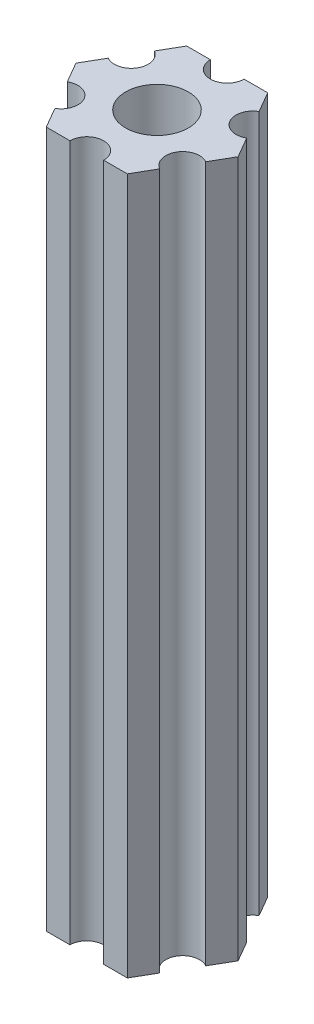
ISO-10303-21;
HEADER;
FILE_DESCRIPTION(('STEP AP214'),'2;1');
FILE_NAME('part.step','',(''),(''),'','','');
FILE_SCHEMA(('AUTOMOTIVE_DESIGN { 1 0 10303 214 1 1 1 1 }'));
ENDSEC;
DATA;
#1=APPLICATION_CONTEXT('core data for automotive mechanical design processes');
#2=APPLICATION_PROTOCOL_DEFINITION('international standard','automotive_design',2000,#1);
#3=PRODUCT_CONTEXT('',#1,'mechanical');
#4=PRODUCT('Part','Part','',(#3));
#5=PRODUCT_RELATED_PRODUCT_CATEGORY('part','',(#4));
#6=PRODUCT_DEFINITION_FORMATION('','',#4);
#7=PRODUCT_DEFINITION_CONTEXT('part definition',#1,'design');
#8=PRODUCT_DEFINITION('design','',#6,#7);
#9=PRODUCT_DEFINITION_SHAPE('','',#8);
#10=(LENGTH_UNIT() NAMED_UNIT(*) SI_UNIT(.MILLI.,.METRE.));
#11=(NAMED_UNIT(*) PLANE_ANGLE_UNIT() SI_UNIT($,.RADIAN.));
#12=(NAMED_UNIT(*) SI_UNIT($,.STERADIAN.) SOLID_ANGLE_UNIT());
#13=UNCERTAINTY_MEASURE_WITH_UNIT(LENGTH_MEASURE(1.E-05),#10,'distance_accuracy_value','');
#14=(GEOMETRIC_REPRESENTATION_CONTEXT(3) GLOBAL_UNCERTAINTY_ASSIGNED_CONTEXT((#13)) GLOBAL_UNIT_ASSIGNED_CONTEXT((#10,
#11,#12)) REPRESENTATION_CONTEXT('',''));
#15=CARTESIAN_POINT('',(0.,0.,0.));
#16=DIRECTION('',(0.,0.,1.));
#17=DIRECTION('',(1.,0.,0.));
#18=AXIS2_PLACEMENT_3D('',#15,#16,#17);
#19=CARTESIAN_POINT('',(5.41265877365274,23.,3.125));
#20=DIRECTION('',(0.,1.,0.));
#21=DIRECTION('',(0.,0.,1.));
#22=AXIS2_PLACEMENT_3D('',#19,#20,#21);
#23=CYLINDRICAL_SURFACE('',#22,1.5);
#24=CARTESIAN_POINT('',(5.41265877365274,85.,3.125));
#25=DIRECTION('',(0.,-1.,0.));
#26=DIRECTION('',(0.,0.,-1.));
#27=AXIS2_PLACEMENT_3D('',#24,#25,#26);
#28=CIRCLE('',#27,1.5);
#29=CARTESIAN_POINT('',(4.66265877365274,85.,4.42403810567666));
#30=VERTEX_POINT('',#29);
#31=CARTESIAN_POINT('',(6.16265877365274,85.,1.82596189432335));
#32=VERTEX_POINT('',#31);
#33=EDGE_CURVE('E189',#30,#32,#28,.T.);
#34=ORIENTED_EDGE('',*,*,#33,.F.);
#35=DIRECTION('',(0.,1.,0.));
#36=VECTOR('',#35,1.);
#37=CARTESIAN_POINT('',(4.66265877365274,23.,4.42403810567666));
#38=LINE('',#37,#36);
#39=CARTESIAN_POINT('',(4.66265877365274,23.,4.42403810567666));
#40=VERTEX_POINT('',#39);
#41=EDGE_CURVE('E11',#40,#30,#38,.T.);
#42=ORIENTED_EDGE('',*,*,#41,.F.);
#43=CARTESIAN_POINT('',(5.41265877365274,23.,3.125));
#44=DIRECTION('',(0.,-1.,0.));
#45=DIRECTION('',(0.,0.,-1.));
#46=AXIS2_PLACEMENT_3D('',#43,#44,#45);
#47=CIRCLE('',#46,1.5);
#48=CARTESIAN_POINT('',(6.16265877365274,23.,1.82596189432335));
#49=VERTEX_POINT('',#48);
#50=EDGE_CURVE('E240',#40,#49,#47,.T.);
#51=ORIENTED_EDGE('',*,*,#50,.T.);
#52=DIRECTION('',(0.,1.,0.));
#53=VECTOR('',#52,1.);
#54=CARTESIAN_POINT('',(6.16265877365274,23.,1.82596189432335));
#55=LINE('',#54,#53);
#56=EDGE_CURVE('E35',#49,#32,#55,.T.);
#57=ORIENTED_EDGE('',*,*,#56,.T.);
#58=EDGE_LOOP('',(#34,#42,#51,#57));
#59=FACE_BOUND('',#58,.T.);
#60=ADVANCED_FACE('F32',(#59),#23,.F.);
#61=CARTESIAN_POINT('',(3.60843918243516,23.,6.25));
#62=DIRECTION('',(0.866025403784439,0.,0.5));
#63=DIRECTION('',(0.5,0.,-0.866025403784439));
#64=AXIS2_PLACEMENT_3D('',#61,#62,#63);
#65=PLANE('',#64);
#66=DIRECTION('',(0.5,0.,-0.866025403784439));
#67=VECTOR('',#66,1.);
#68=CARTESIAN_POINT('',(3.60843918243516,85.,6.25));
#69=LINE('',#68,#67);
#70=CARTESIAN_POINT('',(3.60843918243516,85.,6.25));
#71=VERTEX_POINT('',#70);
#72=EDGE_CURVE('E238',#71,#30,#69,.T.);
#73=ORIENTED_EDGE('',*,*,#72,.F.);
#74=DIRECTION('',(0.,1.,0.));
#75=VECTOR('',#74,1.);
#76=CARTESIAN_POINT('',(3.60843918243516,23.,6.25));
#77=LINE('',#76,#75);
#78=CARTESIAN_POINT('',(3.60843918243516,23.,6.25));
#79=VERTEX_POINT('',#78);
#80=EDGE_CURVE('E41',#79,#71,#77,.T.);
#81=ORIENTED_EDGE('',*,*,#80,.F.);
#82=DIRECTION('',(0.5,0.,-0.866025403784439));
#83=VECTOR('',#82,1.);
#84=CARTESIAN_POINT('',(3.60843918243516,23.,6.25));
#85=LINE('',#84,#83);
#86=EDGE_CURVE('E179',#79,#40,#85,.T.);
#87=ORIENTED_EDGE('',*,*,#86,.T.);
#88=ORIENTED_EDGE('',*,*,#41,.T.);
#89=EDGE_LOOP('',(#73,#81,#87,#88));
#90=FACE_BOUND('',#89,.T.);
#91=ADVANCED_FACE('F272',(#90),#65,.T.);
#92=CARTESIAN_POINT('',(1.5,23.,6.25));
#93=DIRECTION('',(0.,0.,1.));
#94=DIRECTION('',(1.,0.,0.));
#95=AXIS2_PLACEMENT_3D('',#92,#93,#94);
#96=PLANE('',#95);
#97=DIRECTION('',(1.,0.,0.));
#98=VECTOR('',#97,1.);
#99=CARTESIAN_POINT('',(1.5,85.,6.25));
#100=LINE('',#99,#98);
#101=CARTESIAN_POINT('',(1.5,85.,6.25));
#102=VERTEX_POINT('',#101);
#103=EDGE_CURVE('E166',#102,#71,#100,.T.);
#104=ORIENTED_EDGE('',*,*,#103,.F.);
#105=DIRECTION('',(0.,1.,0.));
#106=VECTOR('',#105,1.);
#107=CARTESIAN_POINT('',(1.5,23.,6.25));
#108=LINE('',#107,#106);
#109=CARTESIAN_POINT('',(1.5,23.,6.25));
#110=VERTEX_POINT('',#109);
#111=EDGE_CURVE('E161',#110,#102,#108,.T.);
#112=ORIENTED_EDGE('',*,*,#111,.F.);
#113=DIRECTION('',(1.,0.,0.));
#114=VECTOR('',#113,1.);
#115=CARTESIAN_POINT('',(1.5,23.,6.25));
#116=LINE('',#115,#114);
#117=EDGE_CURVE('E164',#110,#79,#116,.T.);
#118=ORIENTED_EDGE('',*,*,#117,.T.);
#119=ORIENTED_EDGE('',*,*,#80,.T.);
#120=EDGE_LOOP('',(#104,#112,#118,#119));
#121=FACE_BOUND('',#120,.T.);
#122=ADVANCED_FACE('F163',(#121),#96,.T.);
#123=CARTESIAN_POINT('',(0.,23.,6.25));
#124=DIRECTION('',(0.,1.,0.));
#125=DIRECTION('',(0.,0.,1.));
#126=AXIS2_PLACEMENT_3D('',#123,#124,#125);
#127=CYLINDRICAL_SURFACE('',#126,1.5);
#128=CARTESIAN_POINT('',(0.,85.,6.25));
#129=DIRECTION('',(0.,-1.,0.));
#130=DIRECTION('',(0.,0.,-1.));
#131=AXIS2_PLACEMENT_3D('',#128,#129,#130);
#132=CIRCLE('',#131,1.5);
#133=CARTESIAN_POINT('',(-1.5,85.,6.25));
#134=VERTEX_POINT('',#133);
#135=EDGE_CURVE('E235',#134,#102,#132,.T.);
#136=ORIENTED_EDGE('',*,*,#135,.F.);
#137=DIRECTION('',(0.,1.,0.));
#138=VECTOR('',#137,1.);
#139=CARTESIAN_POINT('',(-1.5,23.,6.25));
#140=LINE('',#139,#138);
#141=CARTESIAN_POINT('',(-1.5,23.,6.25));
#142=VERTEX_POINT('',#141);
#143=EDGE_CURVE('E171',#142,#134,#140,.T.);
#144=ORIENTED_EDGE('',*,*,#143,.F.);
#145=CARTESIAN_POINT('',(0.,23.,6.25));
#146=DIRECTION('',(0.,-1.,0.));
#147=DIRECTION('',(0.,0.,-1.));
#148=AXIS2_PLACEMENT_3D('',#145,#146,#147);
#149=CIRCLE('',#148,1.5);
#150=EDGE_CURVE('E177',#142,#110,#149,.T.);
#151=ORIENTED_EDGE('',*,*,#150,.T.);
#152=ORIENTED_EDGE('',*,*,#111,.T.);
#153=EDGE_LOOP('',(#136,#144,#151,#152));
#154=FACE_BOUND('',#153,.T.);
#155=ADVANCED_FACE('F181',(#154),#127,.F.);
#156=CARTESIAN_POINT('',(-3.60843918243516,23.,6.25));
#157=DIRECTION('',(0.,0.,1.));
#158=DIRECTION('',(1.,0.,0.));
#159=AXIS2_PLACEMENT_3D('',#156,#157,#158);
#160=PLANE('',#159);
#161=DIRECTION('',(1.,0.,0.));
#162=VECTOR('',#161,1.);
#163=CARTESIAN_POINT('',(-3.60843918243516,85.,6.25));
#164=LINE('',#163,#162);
#165=CARTESIAN_POINT('',(-3.60843918243516,85.,6.25));
#166=VERTEX_POINT('',#165);
#167=EDGE_CURVE('E232',#166,#134,#164,.T.);
#168=ORIENTED_EDGE('',*,*,#167,.F.);
#169=DIRECTION('',(0.,1.,0.));
#170=VECTOR('',#169,1.);
#171=CARTESIAN_POINT('',(-3.60843918243516,23.,6.25));
#172=LINE('',#171,#170);
#173=CARTESIAN_POINT('',(-3.60843918243516,23.,6.25));
#174=VERTEX_POINT('',#173);
#175=EDGE_CURVE('E244',#174,#166,#172,.T.);
#176=ORIENTED_EDGE('',*,*,#175,.F.);
#177=DIRECTION('',(1.,0.,0.));
#178=VECTOR('',#177,1.);
#179=CARTESIAN_POINT('',(-3.60843918243516,23.,6.25));
#180=LINE('',#179,#178);
#181=EDGE_CURVE('E182',#174,#142,#180,.T.);
#182=ORIENTED_EDGE('',*,*,#181,.T.);
#183=ORIENTED_EDGE('',*,*,#143,.T.);
#184=EDGE_LOOP('',(#168,#176,#182,#183));
#185=FACE_BOUND('',#184,.T.);
#186=ADVANCED_FACE('F285',(#185),#160,.T.);
#187=CARTESIAN_POINT('',(-4.66265877365274,23.,4.42403810567666));
#188=DIRECTION('',(-0.866025403784439,0.,0.5));
#189=DIRECTION('',(0.5,0.,0.866025403784439));
#190=AXIS2_PLACEMENT_3D('',#187,#188,#189);
#191=PLANE('',#190);
#192=DIRECTION('',(0.5,0.,0.866025403784439));
#193=VECTOR('',#192,1.);
#194=CARTESIAN_POINT('',(-4.66265877365274,85.,4.42403810567666));
#195=LINE('',#194,#193);
#196=CARTESIAN_POINT('',(-4.66265877365274,85.,4.42403810567666));
#197=VERTEX_POINT('',#196);
#198=EDGE_CURVE('E229',#197,#166,#195,.T.);
#199=ORIENTED_EDGE('',*,*,#198,.F.);
#200=DIRECTION('',(0.,1.,0.));
#201=VECTOR('',#200,1.);
#202=CARTESIAN_POINT('',(-4.66265877365274,23.,4.42403810567666));
#203=LINE('',#202,#201);
#204=CARTESIAN_POINT('',(-4.66265877365274,23.,4.42403810567666));
#205=VERTEX_POINT('',#204);
#206=EDGE_CURVE('E246',#205,#197,#203,.T.);
#207=ORIENTED_EDGE('',*,*,#206,.F.);
#208=DIRECTION('',(0.5,0.,0.866025403784439));
#209=VECTOR('',#208,1.);
#210=CARTESIAN_POINT('',(-4.66265877365274,23.,4.42403810567666));
#211=LINE('',#210,#209);
#212=EDGE_CURVE('E184',#205,#174,#211,.T.);
#213=ORIENTED_EDGE('',*,*,#212,.T.);
#214=ORIENTED_EDGE('',*,*,#175,.T.);
#215=EDGE_LOOP('',(#199,#207,#213,#214));
#216=FACE_BOUND('',#215,.T.);
#217=ADVANCED_FACE('F288',(#216),#191,.T.);
#218=CARTESIAN_POINT('',(-5.41265877365274,23.,3.125));
#219=DIRECTION('',(0.,1.,0.));
#220=DIRECTION('',(0.,0.,1.));
#221=AXIS2_PLACEMENT_3D('',#218,#219,#220);
#222=CYLINDRICAL_SURFACE('',#221,1.5);
#223=CARTESIAN_POINT('',(-5.41265877365274,85.,3.125));
#224=DIRECTION('',(0.,-1.,0.));
#225=DIRECTION('',(0.,0.,-1.));
#226=AXIS2_PLACEMENT_3D('',#223,#224,#225);
#227=CIRCLE('',#226,1.5);
#228=CARTESIAN_POINT('',(-6.16265877365274,85.,1.82596189432335));
#229=VERTEX_POINT('',#228);
#230=EDGE_CURVE('E226',#229,#197,#227,.T.);
#231=ORIENTED_EDGE('',*,*,#230,.F.);
#232=DIRECTION('',(0.,1.,0.));
#233=VECTOR('',#232,1.);
#234=CARTESIAN_POINT('',(-6.16265877365274,23.,1.82596189432335));
#235=LINE('',#234,#233);
#236=CARTESIAN_POINT('',(-6.16265877365274,23.,1.82596189432335));
#237=VERTEX_POINT('',#236);
#238=EDGE_CURVE('E248',#237,#229,#235,.T.);
#239=ORIENTED_EDGE('',*,*,#238,.F.);
#240=CARTESIAN_POINT('',(-5.41265877365274,23.,3.125));
#241=DIRECTION('',(0.,-1.,0.));
#242=DIRECTION('',(0.,0.,-1.));
#243=AXIS2_PLACEMENT_3D('',#240,#241,#242);
#244=CIRCLE('',#243,1.5);
#245=EDGE_CURVE('E393',#237,#205,#244,.T.);
#246=ORIENTED_EDGE('',*,*,#245,.T.);
#247=ORIENTED_EDGE('',*,*,#206,.T.);
#248=EDGE_LOOP('',(#231,#239,#246,#247));
#249=FACE_BOUND('',#248,.T.);
#250=ADVANCED_FACE('F292',(#249),#222,.F.);
#251=CARTESIAN_POINT('',(-7.21687836487032,23.,0.));
#252=DIRECTION('',(-0.86602540378444,0.,0.499999999999998));
#253=DIRECTION('',(0.499999999999998,0.,0.86602540378444));
#254=AXIS2_PLACEMENT_3D('',#251,#252,#253);
#255=PLANE('',#254);
#256=DIRECTION('',(0.499999999999998,0.,0.86602540378444));
#257=VECTOR('',#256,1.);
#258=CARTESIAN_POINT('',(-7.21687836487032,85.,0.));
#259=LINE('',#258,#257);
#260=CARTESIAN_POINT('',(-7.21687836487032,85.,0.));
#261=VERTEX_POINT('',#260);
#262=EDGE_CURVE('E223',#261,#229,#259,.T.);
#263=ORIENTED_EDGE('',*,*,#262,.F.);
#264=DIRECTION('',(0.,1.,0.));
#265=VECTOR('',#264,1.);
#266=CARTESIAN_POINT('',(-7.21687836487032,23.,0.));
#267=LINE('',#266,#265);
#268=CARTESIAN_POINT('',(-7.21687836487032,23.,0.));
#269=VERTEX_POINT('',#268);
#270=EDGE_CURVE('E250',#269,#261,#267,.T.);
#271=ORIENTED_EDGE('',*,*,#270,.F.);
#272=DIRECTION('',(0.499999999999998,0.,0.86602540378444));
#273=VECTOR('',#272,1.);
#274=CARTESIAN_POINT('',(-7.21687836487032,23.,0.));
#275=LINE('',#274,#273);
#276=EDGE_CURVE('E390',#269,#237,#275,.T.);
#277=ORIENTED_EDGE('',*,*,#276,.T.);
#278=ORIENTED_EDGE('',*,*,#238,.T.);
#279=EDGE_LOOP('',(#263,#271,#277,#278));
#280=FACE_BOUND('',#279,.T.);
#281=ADVANCED_FACE('F296',(#280),#255,.T.);
#282=CARTESIAN_POINT('',(-6.16265877365274,23.,-1.82596189432334));
#283=DIRECTION('',(-0.866025403784438,0.,-0.5));
#284=DIRECTION('',(-0.5,0.,0.866025403784438));
#285=AXIS2_PLACEMENT_3D('',#282,#283,#284);
#286=PLANE('',#285);
#287=DIRECTION('',(-0.5,0.,0.866025403784438));
#288=VECTOR('',#287,1.);
#289=CARTESIAN_POINT('',(-6.16265877365274,85.,-1.82596189432334));
#290=LINE('',#289,#288);
#291=CARTESIAN_POINT('',(-6.16265877365274,85.,-1.82596189432334));
#292=VERTEX_POINT('',#291);
#293=EDGE_CURVE('E220',#292,#261,#290,.T.);
#294=ORIENTED_EDGE('',*,*,#293,.F.);
#295=DIRECTION('',(0.,1.,0.));
#296=VECTOR('',#295,1.);
#297=CARTESIAN_POINT('',(-6.16265877365274,23.,-1.82596189432334));
#298=LINE('',#297,#296);
#299=CARTESIAN_POINT('',(-6.16265877365274,23.,-1.82596189432334));
#300=VERTEX_POINT('',#299);
#301=EDGE_CURVE('E252',#300,#292,#298,.T.);
#302=ORIENTED_EDGE('',*,*,#301,.F.);
#303=DIRECTION('',(-0.5,0.,0.866025403784438));
#304=VECTOR('',#303,1.);
#305=CARTESIAN_POINT('',(-6.16265877365274,23.,-1.82596189432334));
#306=LINE('',#305,#304);
#307=EDGE_CURVE('E387',#300,#269,#306,.T.);
#308=ORIENTED_EDGE('',*,*,#307,.T.);
#309=ORIENTED_EDGE('',*,*,#270,.T.);
#310=EDGE_LOOP('',(#294,#302,#308,#309));
#311=FACE_BOUND('',#310,.T.);
#312=ADVANCED_FACE('F300',(#311),#286,.T.);
#313=CARTESIAN_POINT('',(-5.41265877365274,23.,-3.125));
#314=DIRECTION('',(0.,1.,0.));
#315=DIRECTION('',(0.,0.,1.));
#316=AXIS2_PLACEMENT_3D('',#313,#314,#315);
#317=CYLINDRICAL_SURFACE('',#316,1.5);
#318=CARTESIAN_POINT('',(-5.41265877365274,85.,-3.125));
#319=DIRECTION('',(0.,-1.,0.));
#320=DIRECTION('',(0.,0.,-1.));
#321=AXIS2_PLACEMENT_3D('',#318,#319,#320);
#322=CIRCLE('',#321,1.5);
#323=CARTESIAN_POINT('',(-4.66265877365274,85.,-4.42403810567666));
#324=VERTEX_POINT('',#323);
#325=EDGE_CURVE('E217',#324,#292,#322,.T.);
#326=ORIENTED_EDGE('',*,*,#325,.F.);
#327=DIRECTION('',(0.,1.,0.));
#328=VECTOR('',#327,1.);
#329=CARTESIAN_POINT('',(-4.66265877365274,23.,-4.42403810567666));
#330=LINE('',#329,#328);
#331=CARTESIAN_POINT('',(-4.66265877365274,23.,-4.42403810567666));
#332=VERTEX_POINT('',#331);
#333=EDGE_CURVE('E254',#332,#324,#330,.T.);
#334=ORIENTED_EDGE('',*,*,#333,.F.);
#335=CARTESIAN_POINT('',(-5.41265877365274,23.,-3.125));
#336=DIRECTION('',(0.,-1.,0.));
#337=DIRECTION('',(0.,0.,-1.));
#338=AXIS2_PLACEMENT_3D('',#335,#336,#337);
#339=CIRCLE('',#338,1.5);
#340=EDGE_CURVE('E384',#332,#300,#339,.T.);
#341=ORIENTED_EDGE('',*,*,#340,.T.);
#342=ORIENTED_EDGE('',*,*,#301,.T.);
#343=EDGE_LOOP('',(#326,#334,#341,#342));
#344=FACE_BOUND('',#343,.T.);
#345=ADVANCED_FACE('F304',(#344),#317,.F.);
#346=CARTESIAN_POINT('',(-3.60843918243516,23.,-6.25));
#347=DIRECTION('',(-0.866025403784439,0.,-0.5));
#348=DIRECTION('',(-0.5,0.,0.866025403784439));
#349=AXIS2_PLACEMENT_3D('',#346,#347,#348);
#350=PLANE('',#349);
#351=DIRECTION('',(-0.5,0.,0.866025403784439));
#352=VECTOR('',#351,1.);
#353=CARTESIAN_POINT('',(-3.60843918243516,85.,-6.25));
#354=LINE('',#353,#352);
#355=CARTESIAN_POINT('',(-3.60843918243516,85.,-6.25));
#356=VERTEX_POINT('',#355);
#357=EDGE_CURVE('E214',#356,#324,#354,.T.);
#358=ORIENTED_EDGE('',*,*,#357,.F.);
#359=DIRECTION('',(0.,1.,0.));
#360=VECTOR('',#359,1.);
#361=CARTESIAN_POINT('',(-3.60843918243516,23.,-6.25));
#362=LINE('',#361,#360);
#363=CARTESIAN_POINT('',(-3.60843918243516,23.,-6.25));
#364=VERTEX_POINT('',#363);
#365=EDGE_CURVE('E256',#364,#356,#362,.T.);
#366=ORIENTED_EDGE('',*,*,#365,.F.);
#367=DIRECTION('',(-0.5,0.,0.866025403784439));
#368=VECTOR('',#367,1.);
#369=CARTESIAN_POINT('',(-3.60843918243516,23.,-6.25));
#370=LINE('',#369,#368);
#371=EDGE_CURVE('E381',#364,#332,#370,.T.);
#372=ORIENTED_EDGE('',*,*,#371,.T.);
#373=ORIENTED_EDGE('',*,*,#333,.T.);
#374=EDGE_LOOP('',(#358,#366,#372,#373));
#375=FACE_BOUND('',#374,.T.);
#376=ADVANCED_FACE('F308',(#375),#350,.T.);
#377=CARTESIAN_POINT('',(-1.5,23.,-6.25));
#378=DIRECTION('',(0.,0.,-1.));
#379=DIRECTION('',(-1.,0.,0.));
#380=AXIS2_PLACEMENT_3D('',#377,#378,#379);
#381=PLANE('',#380);
#382=DIRECTION('',(-1.,0.,0.));
#383=VECTOR('',#382,1.);
#384=CARTESIAN_POINT('',(-1.5,85.,-6.25));
#385=LINE('',#384,#383);
#386=CARTESIAN_POINT('',(-1.5,85.,-6.25));
#387=VERTEX_POINT('',#386);
#388=EDGE_CURVE('E211',#387,#356,#385,.T.);
#389=ORIENTED_EDGE('',*,*,#388,.F.);
#390=DIRECTION('',(0.,1.,0.));
#391=VECTOR('',#390,1.);
#392=CARTESIAN_POINT('',(-1.5,23.,-6.25));
#393=LINE('',#392,#391);
#394=CARTESIAN_POINT('',(-1.5,23.,-6.25));
#395=VERTEX_POINT('',#394);
#396=EDGE_CURVE('E258',#395,#387,#393,.T.);
#397=ORIENTED_EDGE('',*,*,#396,.F.);
#398=DIRECTION('',(-1.,0.,0.));
#399=VECTOR('',#398,1.);
#400=CARTESIAN_POINT('',(-1.5,23.,-6.25));
#401=LINE('',#400,#399);
#402=EDGE_CURVE('E378',#395,#364,#401,.T.);
#403=ORIENTED_EDGE('',*,*,#402,.T.);
#404=ORIENTED_EDGE('',*,*,#365,.T.);
#405=EDGE_LOOP('',(#389,#397,#403,#404));
#406=FACE_BOUND('',#405,.T.);
#407=ADVANCED_FACE('F312',(#406),#381,.T.);
#408=CARTESIAN_POINT('',(0.,23.,-6.25));
#409=DIRECTION('',(0.,1.,0.));
#410=DIRECTION('',(0.,0.,1.));
#411=AXIS2_PLACEMENT_3D('',#408,#409,#410);
#412=CYLINDRICAL_SURFACE('',#411,1.5);
#413=CARTESIAN_POINT('',(0.,85.,-6.25));
#414=DIRECTION('',(0.,-1.,0.));
#415=DIRECTION('',(0.,0.,-1.));
#416=AXIS2_PLACEMENT_3D('',#413,#414,#415);
#417=CIRCLE('',#416,1.5);
#418=CARTESIAN_POINT('',(1.5,85.,-6.25));
#419=VERTEX_POINT('',#418);
#420=EDGE_CURVE('E208',#419,#387,#417,.T.);
#421=ORIENTED_EDGE('',*,*,#420,.F.);
#422=DIRECTION('',(0.,1.,0.));
#423=VECTOR('',#422,1.);
#424=CARTESIAN_POINT('',(1.5,23.,-6.25));
#425=LINE('',#424,#423);
#426=CARTESIAN_POINT('',(1.5,23.,-6.25));
#427=VERTEX_POINT('',#426);
#428=EDGE_CURVE('E260',#427,#419,#425,.T.);
#429=ORIENTED_EDGE('',*,*,#428,.F.);
#430=CARTESIAN_POINT('',(0.,23.,-6.25));
#431=DIRECTION('',(0.,-1.,0.));
#432=DIRECTION('',(0.,0.,-1.));
#433=AXIS2_PLACEMENT_3D('',#430,#431,#432);
#434=CIRCLE('',#433,1.5);
#435=EDGE_CURVE('E375',#427,#395,#434,.T.);
#436=ORIENTED_EDGE('',*,*,#435,.T.);
#437=ORIENTED_EDGE('',*,*,#396,.T.);
#438=EDGE_LOOP('',(#421,#429,#436,#437));
#439=FACE_BOUND('',#438,.T.);
#440=ADVANCED_FACE('F316',(#439),#412,.F.);
#441=CARTESIAN_POINT('',(3.60843918243516,23.,-6.25));
#442=DIRECTION('',(0.,0.,-1.));
#443=DIRECTION('',(-1.,0.,0.));
#444=AXIS2_PLACEMENT_3D('',#441,#442,#443);
#445=PLANE('',#444);
#446=DIRECTION('',(-1.,0.,0.));
#447=VECTOR('',#446,1.);
#448=CARTESIAN_POINT('',(3.60843918243516,85.,-6.25));
#449=LINE('',#448,#447);
#450=CARTESIAN_POINT('',(3.60843918243516,85.,-6.25));
#451=VERTEX_POINT('',#450);
#452=EDGE_CURVE('E205',#451,#419,#449,.T.);
#453=ORIENTED_EDGE('',*,*,#452,.F.);
#454=DIRECTION('',(0.,1.,0.));
#455=VECTOR('',#454,1.);
#456=CARTESIAN_POINT('',(3.60843918243516,23.,-6.25));
#457=LINE('',#456,#455);
#458=CARTESIAN_POINT('',(3.60843918243516,23.,-6.25));
#459=VERTEX_POINT('',#458);
#460=EDGE_CURVE('E262',#459,#451,#457,.T.);
#461=ORIENTED_EDGE('',*,*,#460,.F.);
#462=DIRECTION('',(-1.,0.,0.));
#463=VECTOR('',#462,1.);
#464=CARTESIAN_POINT('',(3.60843918243516,23.,-6.25));
#465=LINE('',#464,#463);
#466=EDGE_CURVE('E372',#459,#427,#465,.T.);
#467=ORIENTED_EDGE('',*,*,#466,.T.);
#468=ORIENTED_EDGE('',*,*,#428,.T.);
#469=EDGE_LOOP('',(#453,#461,#467,#468));
#470=FACE_BOUND('',#469,.T.);
#471=ADVANCED_FACE('F320',(#470),#445,.T.);
#472=CARTESIAN_POINT('',(4.66265877365274,23.,-4.42403810567666));
#473=DIRECTION('',(0.866025403784439,0.,-0.5));
#474=DIRECTION('',(-0.5,0.,-0.866025403784439));
#475=AXIS2_PLACEMENT_3D('',#472,#473,#474);
#476=PLANE('',#475);
#477=DIRECTION('',(-0.5,0.,-0.866025403784439));
#478=VECTOR('',#477,1.);
#479=CARTESIAN_POINT('',(4.66265877365274,85.,-4.42403810567666));
#480=LINE('',#479,#478);
#481=CARTESIAN_POINT('',(4.66265877365274,85.,-4.42403810567666));
#482=VERTEX_POINT('',#481);
#483=EDGE_CURVE('E202',#482,#451,#480,.T.);
#484=ORIENTED_EDGE('',*,*,#483,.F.);
#485=DIRECTION('',(0.,1.,0.));
#486=VECTOR('',#485,1.);
#487=CARTESIAN_POINT('',(4.66265877365274,23.,-4.42403810567666));
#488=LINE('',#487,#486);
#489=CARTESIAN_POINT('',(4.66265877365274,23.,-4.42403810567666));
#490=VERTEX_POINT('',#489);
#491=EDGE_CURVE('E264',#490,#482,#488,.T.);
#492=ORIENTED_EDGE('',*,*,#491,.F.);
#493=DIRECTION('',(-0.5,0.,-0.866025403784439));
#494=VECTOR('',#493,1.);
#495=CARTESIAN_POINT('',(4.66265877365274,23.,-4.42403810567666));
#496=LINE('',#495,#494);
#497=EDGE_CURVE('E369',#490,#459,#496,.T.);
#498=ORIENTED_EDGE('',*,*,#497,.T.);
#499=ORIENTED_EDGE('',*,*,#460,.T.);
#500=EDGE_LOOP('',(#484,#492,#498,#499));
#501=FACE_BOUND('',#500,.T.);
#502=ADVANCED_FACE('F324',(#501),#476,.T.);
#503=CARTESIAN_POINT('',(5.41265877365274,23.,-3.125));
#504=DIRECTION('',(0.,1.,0.));
#505=DIRECTION('',(0.,0.,1.));
#506=AXIS2_PLACEMENT_3D('',#503,#504,#505);
#507=CYLINDRICAL_SURFACE('',#506,1.5);
#508=CARTESIAN_POINT('',(5.41265877365274,85.,-3.125));
#509=DIRECTION('',(0.,-1.,0.));
#510=DIRECTION('',(0.,0.,-1.));
#511=AXIS2_PLACEMENT_3D('',#508,#509,#510);
#512=CIRCLE('',#511,1.5);
#513=CARTESIAN_POINT('',(6.16265877365274,85.,-1.82596189432334));
#514=VERTEX_POINT('',#513);
#515=EDGE_CURVE('E199',#514,#482,#512,.T.);
#516=ORIENTED_EDGE('',*,*,#515,.F.);
#517=DIRECTION('',(0.,1.,0.));
#518=VECTOR('',#517,1.);
#519=CARTESIAN_POINT('',(6.16265877365274,23.,-1.82596189432334));
#520=LINE('',#519,#518);
#521=CARTESIAN_POINT('',(6.16265877365274,23.,-1.82596189432334));
#522=VERTEX_POINT('',#521);
#523=EDGE_CURVE('E266',#522,#514,#520,.T.);
#524=ORIENTED_EDGE('',*,*,#523,.F.);
#525=CARTESIAN_POINT('',(5.41265877365274,23.,-3.125));
#526=DIRECTION('',(0.,-1.,0.));
#527=DIRECTION('',(0.,0.,-1.));
#528=AXIS2_PLACEMENT_3D('',#525,#526,#527);
#529=CIRCLE('',#528,1.5);
#530=EDGE_CURVE('E366',#522,#490,#529,.T.);
#531=ORIENTED_EDGE('',*,*,#530,.T.);
#532=ORIENTED_EDGE('',*,*,#491,.T.);
#533=EDGE_LOOP('',(#516,#524,#531,#532));
#534=FACE_BOUND('',#533,.T.);
#535=ADVANCED_FACE('F328',(#534),#507,.F.);
#536=CARTESIAN_POINT('',(7.21687836487032,23.,0.));
#537=DIRECTION('',(0.866025403784439,0.,-0.5));
#538=DIRECTION('',(-0.5,0.,-0.866025403784439));
#539=AXIS2_PLACEMENT_3D('',#536,#537,#538);
#540=PLANE('',#539);
#541=DIRECTION('',(-0.5,0.,-0.866025403784439));
#542=VECTOR('',#541,1.);
#543=CARTESIAN_POINT('',(7.21687836487032,85.,0.));
#544=LINE('',#543,#542);
#545=CARTESIAN_POINT('',(7.21687836487032,85.,0.));
#546=VERTEX_POINT('',#545);
#547=EDGE_CURVE('E196',#546,#514,#544,.T.);
#548=ORIENTED_EDGE('',*,*,#547,.F.);
#549=DIRECTION('',(0.,1.,0.));
#550=VECTOR('',#549,1.);
#551=CARTESIAN_POINT('',(7.21687836487032,23.,0.));
#552=LINE('',#551,#550);
#553=CARTESIAN_POINT('',(7.21687836487032,23.,0.));
#554=VERTEX_POINT('',#553);
#555=EDGE_CURVE('E267',#554,#546,#552,.T.);
#556=ORIENTED_EDGE('',*,*,#555,.F.);
#557=DIRECTION('',(-0.5,0.,-0.866025403784439));
#558=VECTOR('',#557,1.);
#559=CARTESIAN_POINT('',(7.21687836487032,23.,0.));
#560=LINE('',#559,#558);
#561=EDGE_CURVE('E363',#554,#522,#560,.T.);
#562=ORIENTED_EDGE('',*,*,#561,.T.);
#563=ORIENTED_EDGE('',*,*,#523,.T.);
#564=EDGE_LOOP('',(#548,#556,#562,#563));
#565=FACE_BOUND('',#564,.T.);
#566=ADVANCED_FACE('F332',(#565),#540,.T.);
#567=CARTESIAN_POINT('',(6.16265877365274,23.,1.82596189432335));
#568=DIRECTION('',(0.86602540378444,0.,0.499999999999999));
#569=DIRECTION('',(0.499999999999999,0.,-0.86602540378444));
#570=AXIS2_PLACEMENT_3D('',#567,#568,#569);
#571=PLANE('',#570);
#572=DIRECTION('',(0.499999999999999,0.,-0.86602540378444));
#573=VECTOR('',#572,1.);
#574=CARTESIAN_POINT('',(6.16265877365274,85.,1.82596189432335));
#575=LINE('',#574,#573);
#576=EDGE_CURVE('E192',#32,#546,#575,.T.);
#577=ORIENTED_EDGE('',*,*,#576,.F.);
#578=ORIENTED_EDGE('',*,*,#56,.F.);
#579=DIRECTION('',(0.499999999999999,0.,-0.86602540378444));
#580=VECTOR('',#579,1.);
#581=CARTESIAN_POINT('',(6.16265877365274,23.,1.82596189432335));
#582=LINE('',#581,#580);
#583=EDGE_CURVE('E361',#49,#554,#582,.T.);
#584=ORIENTED_EDGE('',*,*,#583,.T.);
#585=ORIENTED_EDGE('',*,*,#555,.T.);
#586=EDGE_LOOP('',(#577,#578,#584,#585));
#587=FACE_BOUND('',#586,.T.);
#588=ADVANCED_FACE('F269',(#587),#571,.T.);
#589=CARTESIAN_POINT('',(5.41265877365274,23.,3.125));
#590=DIRECTION('',(0.,-1.,0.));
#591=DIRECTION('',(0.,0.,-1.));
#592=AXIS2_PLACEMENT_3D('',#589,#590,#591);
#593=PLANE('',#592);
#594=CARTESIAN_POINT('',(0.,23.,0.));
#595=DIRECTION('',(0.,1.,0.));
#596=DIRECTION('',(0.,0.,-1.));
#597=AXIS2_PLACEMENT_3D('',#594,#595,#596);
#598=CIRCLE('',#597,2.79);
#599=CARTESIAN_POINT('',(0.,23.,-2.79));
#600=VERTEX_POINT('',#599);
#601=EDGE_CURVE('E193',#600,#600,#598,.T.);
#602=ORIENTED_EDGE('',*,*,#601,.T.);
#603=EDGE_LOOP('',(#602));
#604=FACE_BOUND('',#603,.T.);
#605=ORIENTED_EDGE('',*,*,#50,.F.);
#606=ORIENTED_EDGE('',*,*,#86,.F.);
#607=ORIENTED_EDGE('',*,*,#117,.F.);
#608=ORIENTED_EDGE('',*,*,#150,.F.);
#609=ORIENTED_EDGE('',*,*,#181,.F.);
#610=ORIENTED_EDGE('',*,*,#212,.F.);
#611=ORIENTED_EDGE('',*,*,#245,.F.);
#612=ORIENTED_EDGE('',*,*,#276,.F.);
#613=ORIENTED_EDGE('',*,*,#307,.F.);
#614=ORIENTED_EDGE('',*,*,#340,.F.);
#615=ORIENTED_EDGE('',*,*,#371,.F.);
#616=ORIENTED_EDGE('',*,*,#402,.F.);
#617=ORIENTED_EDGE('',*,*,#435,.F.);
#618=ORIENTED_EDGE('',*,*,#466,.F.);
#619=ORIENTED_EDGE('',*,*,#497,.F.);
#620=ORIENTED_EDGE('',*,*,#530,.F.);
#621=ORIENTED_EDGE('',*,*,#561,.F.);
#622=ORIENTED_EDGE('',*,*,#583,.F.);
#623=EDGE_LOOP('',(#605,#606,#607,#608,#609,#610,#611,#612,#613,#614,#615,#616,#617,#618,#619,
#620,#621,#622));
#624=FACE_BOUND('',#623,.T.);
#625=ADVANCED_FACE('F175',(#604,#624),#593,.T.);
#626=CARTESIAN_POINT('',(5.41265877365274,85.,3.125));
#627=DIRECTION('',(0.,-1.,0.));
#628=DIRECTION('',(0.,0.,-1.));
#629=AXIS2_PLACEMENT_3D('',#626,#627,#628);
#630=PLANE('',#629);
#631=CARTESIAN_POINT('',(0.,85.,0.));
#632=DIRECTION('',(0.,1.,0.));
#633=DIRECTION('',(0.,0.,-1.));
#634=AXIS2_PLACEMENT_3D('',#631,#632,#633);
#635=CIRCLE('',#634,2.79);
#636=CARTESIAN_POINT('',(0.,85.,-2.79));
#637=VERTEX_POINT('',#636);
#638=EDGE_CURVE('E356',#637,#637,#635,.T.);
#639=ORIENTED_EDGE('',*,*,#638,.F.);
#640=EDGE_LOOP('',(#639));
#641=FACE_BOUND('',#640,.T.);
#642=ORIENTED_EDGE('',*,*,#33,.T.);
#643=ORIENTED_EDGE('',*,*,#576,.T.);
#644=ORIENTED_EDGE('',*,*,#547,.T.);
#645=ORIENTED_EDGE('',*,*,#515,.T.);
#646=ORIENTED_EDGE('',*,*,#483,.T.);
#647=ORIENTED_EDGE('',*,*,#452,.T.);
#648=ORIENTED_EDGE('',*,*,#420,.T.);
#649=ORIENTED_EDGE('',*,*,#388,.T.);
#650=ORIENTED_EDGE('',*,*,#357,.T.);
#651=ORIENTED_EDGE('',*,*,#325,.T.);
#652=ORIENTED_EDGE('',*,*,#293,.T.);
#653=ORIENTED_EDGE('',*,*,#262,.T.);
#654=ORIENTED_EDGE('',*,*,#230,.T.);
#655=ORIENTED_EDGE('',*,*,#198,.T.);
#656=ORIENTED_EDGE('',*,*,#167,.T.);
#657=ORIENTED_EDGE('',*,*,#135,.T.);
#658=ORIENTED_EDGE('',*,*,#103,.T.);
#659=ORIENTED_EDGE('',*,*,#72,.T.);
#660=EDGE_LOOP('',(#642,#643,#644,#645,#646,#647,#648,#649,#650,#651,#652,#653,#654,#655,#656,
#657,#658,#659));
#661=FACE_BOUND('',#660,.T.);
#662=ADVANCED_FACE('F271',(#641,#661),#630,.F.);
#663=CARTESIAN_POINT('',(0.,23.,0.));
#664=DIRECTION('',(0.,1.,0.));
#665=DIRECTION('',(0.,0.,1.));
#666=AXIS2_PLACEMENT_3D('',#663,#664,#665);
#667=CYLINDRICAL_SURFACE('',#666,2.79);
#668=ORIENTED_EDGE('',*,*,#601,.F.);
#669=EDGE_LOOP('',(#668));
#670=FACE_BOUND('',#669,.T.);
#671=ORIENTED_EDGE('',*,*,#638,.T.);
#672=EDGE_LOOP('',(#671));
#673=FACE_BOUND('',#672,.T.);
#674=ADVANCED_FACE('F344',(#670,#673),#667,.F.);
#675=CLOSED_SHELL('',(#60,#91,#122,#155,#186,#217,#250,#281,#312,#345,#376,#407,#440,#471,#502,
#535,#566,#588,#625,#662,#674));
#676=MANIFOLD_SOLID_BREP('B2',#675);
#677=ADVANCED_BREP_SHAPE_REPRESENTATION('',(#18,#676),#14);
#678=SHAPE_DEFINITION_REPRESENTATION(#9,#677);
ENDSEC;
END-ISO-10303-21;
